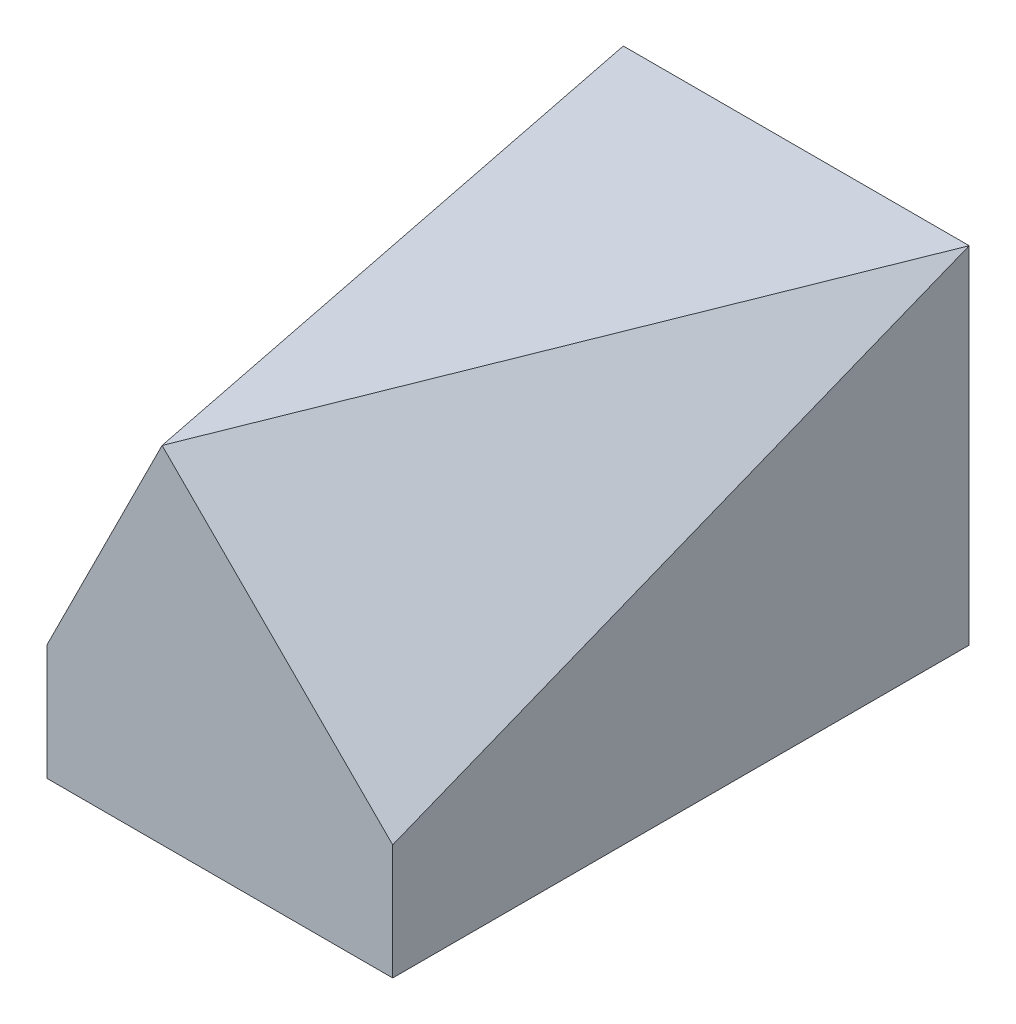
ISO-10303-21;
HEADER;
FILE_DESCRIPTION(('STEP AP214'),'2;1');
FILE_NAME('part.step','',(''),(''),'','','');
FILE_SCHEMA(('AUTOMOTIVE_DESIGN { 1 0 10303 214 1 1 1 1 }'));
ENDSEC;
DATA;
#1=APPLICATION_CONTEXT('core data for automotive mechanical design processes');
#2=APPLICATION_PROTOCOL_DEFINITION('international standard','automotive_design',2000,#1);
#3=PRODUCT_CONTEXT('',#1,'mechanical');
#4=PRODUCT('Part','Part','',(#3));
#5=PRODUCT_RELATED_PRODUCT_CATEGORY('part','',(#4));
#6=PRODUCT_DEFINITION_FORMATION('','',#4);
#7=PRODUCT_DEFINITION_CONTEXT('part definition',#1,'design');
#8=PRODUCT_DEFINITION('design','',#6,#7);
#9=PRODUCT_DEFINITION_SHAPE('','',#8);
#10=(LENGTH_UNIT() NAMED_UNIT(*) SI_UNIT(.MILLI.,.METRE.));
#11=(NAMED_UNIT(*) PLANE_ANGLE_UNIT() SI_UNIT($,.RADIAN.));
#12=(NAMED_UNIT(*) SI_UNIT($,.STERADIAN.) SOLID_ANGLE_UNIT());
#13=UNCERTAINTY_MEASURE_WITH_UNIT(LENGTH_MEASURE(1.E-05),#10,'distance_accuracy_value','');
#14=(GEOMETRIC_REPRESENTATION_CONTEXT(3) GLOBAL_UNCERTAINTY_ASSIGNED_CONTEXT((#13)) GLOBAL_UNIT_ASSIGNED_CONTEXT((#10,
#11,#12)) REPRESENTATION_CONTEXT('',''));
#15=CARTESIAN_POINT('',(0.,0.,0.));
#16=DIRECTION('',(0.,0.,1.));
#17=DIRECTION('',(1.,0.,0.));
#18=AXIS2_PLACEMENT_3D('',#15,#16,#17);
#19=CARTESIAN_POINT('',(-7.5,15.,12.5));
#20=DIRECTION('',(0.,0.,-1.));
#21=DIRECTION('',(-1.,0.,0.));
#22=AXIS2_PLACEMENT_3D('',#19,#20,#21);
#23=PLANE('',#22);
#24=DIRECTION('',(0.707106781186547,-0.707106781186548,0.));
#25=VECTOR('',#24,1.);
#26=CARTESIAN_POINT('',(-5.,17.5,12.5));
#27=LINE('',#26,#25);
#28=CARTESIAN_POINT('',(-2.50000000000001,15.,12.5));
#29=VERTEX_POINT('',#28);
#30=CARTESIAN_POINT('',(7.5,4.99999999999999,12.5));
#31=VERTEX_POINT('',#30);
#32=EDGE_CURVE('E51',#29,#31,#27,.T.);
#33=ORIENTED_EDGE('',*,*,#32,.F.);
#34=DIRECTION('',(0.447213595499958,0.894427190999916,0.));
#35=VECTOR('',#34,1.);
#36=CARTESIAN_POINT('',(-3.5,13.,12.5));
#37=LINE('',#36,#35);
#38=CARTESIAN_POINT('',(-7.5,5.,12.5));
#39=VERTEX_POINT('',#38);
#40=EDGE_CURVE('E115',#39,#29,#37,.T.);
#41=ORIENTED_EDGE('',*,*,#40,.F.);
#42=DIRECTION('',(0.,-1.,0.));
#43=VECTOR('',#42,1.);
#44=CARTESIAN_POINT('',(-7.5,15.,12.5));
#45=LINE('',#44,#43);
#46=CARTESIAN_POINT('',(-7.5,0.,12.5));
#47=VERTEX_POINT('',#46);
#48=EDGE_CURVE('E101',#39,#47,#45,.T.);
#49=ORIENTED_EDGE('',*,*,#48,.T.);
#50=DIRECTION('',(1.,0.,0.));
#51=VECTOR('',#50,1.);
#52=CARTESIAN_POINT('',(-7.5,0.,12.5));
#53=LINE('',#52,#51);
#54=CARTESIAN_POINT('',(7.5,0.,12.5));
#55=VERTEX_POINT('',#54);
#56=EDGE_CURVE('E96',#47,#55,#53,.T.);
#57=ORIENTED_EDGE('',*,*,#56,.T.);
#58=DIRECTION('',(0.,-1.,0.));
#59=VECTOR('',#58,1.);
#60=CARTESIAN_POINT('',(7.5,15.,12.5));
#61=LINE('',#60,#59);
#62=EDGE_CURVE('E58',#31,#55,#61,.T.);
#63=ORIENTED_EDGE('',*,*,#62,.F.);
#64=EDGE_LOOP('',(#33,#41,#49,#57,#63));
#65=FACE_BOUND('',#64,.T.);
#66=ADVANCED_FACE('F37',(#65),#23,.F.);
#67=CARTESIAN_POINT('',(0.,15.,0.));
#68=DIRECTION('',(0.,-1.,0.));
#69=DIRECTION('',(0.,0.,-1.));
#70=AXIS2_PLACEMENT_3D('',#67,#68,#69);
#71=PLANE('',#70);
#72=DIRECTION('',(-0.371390676354104,0.,0.928476690885259));
#73=VECTOR('',#72,1.);
#74=CARTESIAN_POINT('',(2.1551724137931,15.,0.862068965517238));
#75=LINE('',#74,#73);
#76=CARTESIAN_POINT('',(7.5,15.,-12.5));
#77=VERTEX_POINT('',#76);
#78=EDGE_CURVE('E80',#77,#29,#75,.T.);
#79=ORIENTED_EDGE('',*,*,#78,.F.);
#80=DIRECTION('',(-1.,0.,0.));
#81=VECTOR('',#80,1.);
#82=CARTESIAN_POINT('',(-7.5,15.,-12.5));
#83=LINE('',#82,#81);
#84=CARTESIAN_POINT('',(-7.5,15.,-12.5));
#85=VERTEX_POINT('',#84);
#86=EDGE_CURVE('E87',#77,#85,#83,.T.);
#87=ORIENTED_EDGE('',*,*,#86,.T.);
#88=DIRECTION('',(-0.196116135138184,0.,-0.98058067569092));
#89=VECTOR('',#88,1.);
#90=CARTESIAN_POINT('',(-4.80769230769231,15.,0.961538461538462));
#91=LINE('',#90,#89);
#92=EDGE_CURVE('E45',#29,#85,#91,.T.);
#93=ORIENTED_EDGE('',*,*,#92,.F.);
#94=EDGE_LOOP('',(#79,#87,#93));
#95=FACE_BOUND('',#94,.T.);
#96=ADVANCED_FACE('F86',(#95),#71,.F.);
#97=CARTESIAN_POINT('',(7.5,15.,12.5));
#98=DIRECTION('',(-1.,0.,0.));
#99=DIRECTION('',(0.,0.,1.));
#100=AXIS2_PLACEMENT_3D('',#97,#98,#99);
#101=PLANE('',#100);
#102=DIRECTION('',(0.,0.371390676354104,-0.928476690885259));
#103=VECTOR('',#102,1.);
#104=CARTESIAN_POINT('',(7.5,6.37931034482758,9.05172413793103));
#105=LINE('',#104,#103);
#106=EDGE_CURVE('E11',#31,#77,#105,.T.);
#107=ORIENTED_EDGE('',*,*,#106,.F.);
#108=ORIENTED_EDGE('',*,*,#62,.T.);
#109=DIRECTION('',(0.,0.,-1.));
#110=VECTOR('',#109,1.);
#111=CARTESIAN_POINT('',(7.5,0.,12.5));
#112=LINE('',#111,#110);
#113=CARTESIAN_POINT('',(7.5,0.,-12.5));
#114=VERTEX_POINT('',#113);
#115=EDGE_CURVE('E99',#55,#114,#112,.T.);
#116=ORIENTED_EDGE('',*,*,#115,.T.);
#117=DIRECTION('',(0.,-1.,0.));
#118=VECTOR('',#117,1.);
#119=CARTESIAN_POINT('',(7.5,15.,-12.5));
#120=LINE('',#119,#118);
#121=EDGE_CURVE('E93',#77,#114,#120,.T.);
#122=ORIENTED_EDGE('',*,*,#121,.F.);
#123=EDGE_LOOP('',(#107,#108,#116,#122));
#124=FACE_BOUND('',#123,.T.);
#125=ADVANCED_FACE('F39',(#124),#101,.F.);
#126=CARTESIAN_POINT('',(-7.5,15.,12.5));
#127=DIRECTION('',(1.,0.,0.));
#128=DIRECTION('',(0.,0.,-1.));
#129=AXIS2_PLACEMENT_3D('',#126,#127,#128);
#130=PLANE('',#129);
#131=DIRECTION('',(0.,-0.371390676354104,0.928476690885259));
#132=VECTOR('',#131,1.);
#133=CARTESIAN_POINT('',(-7.5,6.37931034482759,9.05172413793104));
#134=LINE('',#133,#132);
#135=EDGE_CURVE('E112',#85,#39,#134,.T.);
#136=ORIENTED_EDGE('',*,*,#135,.F.);
#137=DIRECTION('',(0.,-1.,0.));
#138=VECTOR('',#137,1.);
#139=CARTESIAN_POINT('',(-7.5,15.,-12.5));
#140=LINE('',#139,#138);
#141=CARTESIAN_POINT('',(-7.5,0.,-12.5));
#142=VERTEX_POINT('',#141);
#143=EDGE_CURVE('E95',#85,#142,#140,.T.);
#144=ORIENTED_EDGE('',*,*,#143,.T.);
#145=DIRECTION('',(0.,0.,1.));
#146=VECTOR('',#145,1.);
#147=CARTESIAN_POINT('',(-7.5,0.,12.5));
#148=LINE('',#147,#146);
#149=EDGE_CURVE('E107',#142,#47,#148,.T.);
#150=ORIENTED_EDGE('',*,*,#149,.T.);
#151=ORIENTED_EDGE('',*,*,#48,.F.);
#152=EDGE_LOOP('',(#136,#144,#150,#151));
#153=FACE_BOUND('',#152,.T.);
#154=ADVANCED_FACE('F125',(#153),#130,.F.);
#155=CARTESIAN_POINT('',(-7.5,15.,-12.5));
#156=DIRECTION('',(0.,0.,1.));
#157=DIRECTION('',(1.,0.,0.));
#158=AXIS2_PLACEMENT_3D('',#155,#156,#157);
#159=PLANE('',#158);
#160=DIRECTION('',(-1.,0.,0.));
#161=VECTOR('',#160,1.);
#162=CARTESIAN_POINT('',(-7.5,0.,-12.5));
#163=LINE('',#162,#161);
#164=EDGE_CURVE('E110',#114,#142,#163,.T.);
#165=ORIENTED_EDGE('',*,*,#164,.T.);
#166=ORIENTED_EDGE('',*,*,#143,.F.);
#167=ORIENTED_EDGE('',*,*,#86,.F.);
#168=ORIENTED_EDGE('',*,*,#121,.T.);
#169=EDGE_LOOP('',(#165,#166,#167,#168));
#170=FACE_BOUND('',#169,.T.);
#171=ADVANCED_FACE('F92',(#170),#159,.F.);
#172=CARTESIAN_POINT('',(0.,0.,0.));
#173=DIRECTION('',(0.,-1.,0.));
#174=DIRECTION('',(0.,0.,-1.));
#175=AXIS2_PLACEMENT_3D('',#172,#173,#174);
#176=PLANE('',#175);
#177=ORIENTED_EDGE('',*,*,#115,.F.);
#178=ORIENTED_EDGE('',*,*,#56,.F.);
#179=ORIENTED_EDGE('',*,*,#149,.F.);
#180=ORIENTED_EDGE('',*,*,#164,.F.);
#181=EDGE_LOOP('',(#177,#178,#179,#180));
#182=FACE_BOUND('',#181,.T.);
#183=ADVANCED_FACE('F129',(#182),#176,.T.);
#184=CARTESIAN_POINT('',(-9.68992248062016,4.84496124031008,1.93798449612403));
#185=DIRECTION('',(-0.880450906325624,0.440225453162812,0.176090181265125));
#186=DIRECTION('',(-0.447213595499958,-0.894427190999916,0.));
#187=AXIS2_PLACEMENT_3D('',#184,#185,#186);
#188=PLANE('',#187);
#189=ORIENTED_EDGE('',*,*,#135,.T.);
#190=ORIENTED_EDGE('',*,*,#40,.T.);
#191=ORIENTED_EDGE('',*,*,#92,.T.);
#192=EDGE_LOOP('',(#189,#190,#191));
#193=FACE_BOUND('',#192,.T.);
#194=ADVANCED_FACE('F120',(#193),#188,.T.);
#195=CARTESIAN_POINT('',(8.10185185185185,8.10185185185185,3.24074074074074));
#196=DIRECTION('',(0.680413817439772,0.680413817439772,0.272165526975909));
#197=DIRECTION('',(-0.707106781186547,0.707106781186548,0.));
#198=AXIS2_PLACEMENT_3D('',#195,#196,#197);
#199=PLANE('',#198);
#200=ORIENTED_EDGE('',*,*,#32,.T.);
#201=ORIENTED_EDGE('',*,*,#106,.T.);
#202=ORIENTED_EDGE('',*,*,#78,.T.);
#203=EDGE_LOOP('',(#200,#201,#202));
#204=FACE_BOUND('',#203,.T.);
#205=ADVANCED_FACE('F79',(#204),#199,.T.);
#206=CLOSED_SHELL('',(#66,#96,#125,#154,#171,#183,#194,#205));
#207=MANIFOLD_SOLID_BREP('B2',#206);
#208=ADVANCED_BREP_SHAPE_REPRESENTATION('',(#18,#207),#14);
#209=SHAPE_DEFINITION_REPRESENTATION(#9,#208);
ENDSEC;
END-ISO-10303-21;
